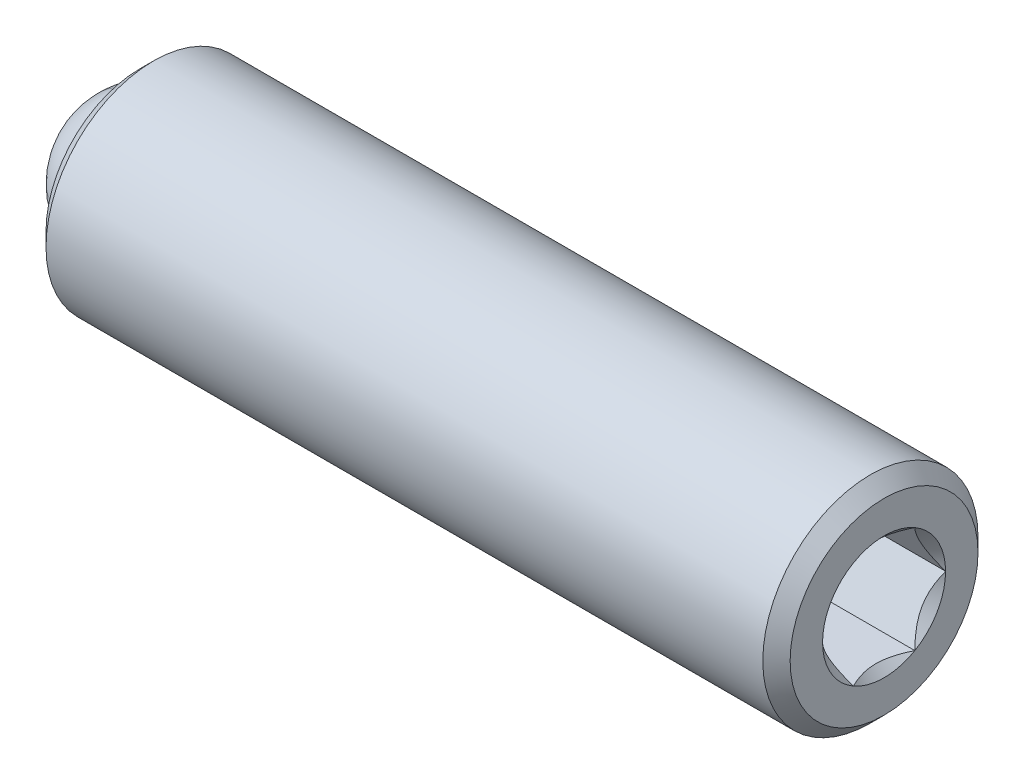
ISO-10303-21;
HEADER;
FILE_DESCRIPTION(('STEP AP214'),'2;1');
FILE_NAME('part.step','',(''),(''),'','','');
FILE_SCHEMA(('AUTOMOTIVE_DESIGN { 1 0 10303 214 1 1 1 1 }'));
ENDSEC;
DATA;
#1=APPLICATION_CONTEXT('core data for automotive mechanical design processes');
#2=APPLICATION_PROTOCOL_DEFINITION('international standard','automotive_design',2000,#1);
#3=PRODUCT_CONTEXT('',#1,'mechanical');
#4=PRODUCT('Part','Part','',(#3));
#5=PRODUCT_RELATED_PRODUCT_CATEGORY('part','',(#4));
#6=PRODUCT_DEFINITION_FORMATION('','',#4);
#7=PRODUCT_DEFINITION_CONTEXT('part definition',#1,'design');
#8=PRODUCT_DEFINITION('design','',#6,#7);
#9=PRODUCT_DEFINITION_SHAPE('','',#8);
#10=(LENGTH_UNIT() NAMED_UNIT(*) SI_UNIT(.MILLI.,.METRE.));
#11=(NAMED_UNIT(*) PLANE_ANGLE_UNIT() SI_UNIT($,.RADIAN.));
#12=(NAMED_UNIT(*) SI_UNIT($,.STERADIAN.) SOLID_ANGLE_UNIT());
#13=UNCERTAINTY_MEASURE_WITH_UNIT(LENGTH_MEASURE(1.E-05),#10,'distance_accuracy_value','');
#14=(GEOMETRIC_REPRESENTATION_CONTEXT(3) GLOBAL_UNCERTAINTY_ASSIGNED_CONTEXT((#13)) GLOBAL_UNIT_ASSIGNED_CONTEXT((#10,
#11,#12)) REPRESENTATION_CONTEXT('',''));
#15=CARTESIAN_POINT('',(0.,0.,0.));
#16=DIRECTION('',(0.,0.,1.));
#17=DIRECTION('',(1.,0.,0.));
#18=AXIS2_PLACEMENT_3D('',#15,#16,#17);
#19=CARTESIAN_POINT('',(-10.7420873794955,5.51648384237069,3.93165241246152));
#20=DIRECTION('',(1.,0.,0.));
#21=DIRECTION('',(0.,0.,-1.));
#22=AXIS2_PLACEMENT_3D('',#19,#20,#21);
#23=PLANE('',#22);
#24=CARTESIAN_POINT('',(-10.7420873794955,5.51648384237069,3.93165241246152));
#25=DIRECTION('',(1.,0.,0.));
#26=DIRECTION('',(0.,0.,-1.));
#27=AXIS2_PLACEMENT_3D('',#24,#25,#26);
#28=CIRCLE('',#27,0.99694999999999);
#29=CARTESIAN_POINT('',(-10.7420873794955,6.10907570675299,3.12993913156373));
#30=VERTEX_POINT('',#29);
#31=CARTESIAN_POINT('',(-10.7420873794955,6.50708384237069,3.81930944427936));
#32=VERTEX_POINT('',#31);
#33=EDGE_CURVE('P0_E11',#30,#32,#28,.T.);
#34=ORIENTED_EDGE('',*,*,#33,.F.);
#35=DIRECTION('',(0.,0.866025403784439,0.5));
#36=VECTOR('',#35,1.);
#37=CARTESIAN_POINT('',(-10.7420873794955,5.51648384237069,2.78780605914303));
#38=LINE('',#37,#36);
#39=CARTESIAN_POINT('',(-10.7420873794955,6.50708384237069,3.35972923580227));
#40=VERTEX_POINT('',#39);
#41=EDGE_CURVE('P0_E247',#30,#40,#38,.T.);
#42=ORIENTED_EDGE('',*,*,#41,.T.);
#43=DIRECTION('',(0.,0.,1.));
#44=VECTOR('',#43,1.);
#45=CARTESIAN_POINT('',(-10.7420873794955,6.50708384237069,3.35972923580227));
#46=LINE('',#45,#44);
#47=EDGE_CURVE('P0_E254',#40,#32,#46,.T.);
#48=ORIENTED_EDGE('',*,*,#47,.T.);
#49=EDGE_LOOP('',(#34,#42,#48));
#50=FACE_BOUND('',#49,.T.);
#51=ADVANCED_FACE('P0_F17',(#50),#23,.T.);
#52=CARTESIAN_POINT('',(-10.7420873794955,6.50708384237069,4.04399538064368));
#53=VERTEX_POINT('',#52);
#54=CARTESIAN_POINT('',(-10.7420873794955,6.10907570675299,4.7333656933593));
#55=VERTEX_POINT('',#54);
#56=EDGE_CURVE('P0_E32',#53,#55,#28,.T.);
#57=ORIENTED_EDGE('',*,*,#56,.F.);
#58=CARTESIAN_POINT('',(-10.7420873794955,6.50708384237069,4.50357558912076));
#59=VERTEX_POINT('',#58);
#60=EDGE_CURVE('P0_E252',#53,#59,#46,.T.);
#61=ORIENTED_EDGE('',*,*,#60,.T.);
#62=DIRECTION('',(0.,-0.866025403784439,0.5));
#63=VECTOR('',#62,1.);
#64=CARTESIAN_POINT('',(-10.7420873794955,6.50708384237069,4.50357558912076));
#65=LINE('',#64,#63);
#66=EDGE_CURVE('P0_E228',#59,#55,#65,.T.);
#67=ORIENTED_EDGE('',*,*,#66,.T.);
#68=EDGE_LOOP('',(#57,#61,#67));
#69=FACE_BOUND('',#68,.T.);
#70=ADVANCED_FACE('P0_F346',(#69),#23,.T.);
#71=CARTESIAN_POINT('',(-10.7420873794955,5.91449197798839,4.84570866154146));
#72=VERTEX_POINT('',#71);
#73=CARTESIAN_POINT('',(-10.7420873794955,5.11847570675299,4.84570866154147));
#74=VERTEX_POINT('',#73);
#75=EDGE_CURVE('P0_E327',#72,#74,#28,.T.);
#76=ORIENTED_EDGE('',*,*,#75,.F.);
#77=CARTESIAN_POINT('',(-10.7420873794955,5.51648384237069,5.07549876578));
#78=VERTEX_POINT('',#77);
#79=EDGE_CURVE('P0_E233',#72,#78,#65,.T.);
#80=ORIENTED_EDGE('',*,*,#79,.T.);
#81=DIRECTION('',(0.,-0.866025403784439,-0.5));
#82=VECTOR('',#81,1.);
#83=CARTESIAN_POINT('',(-10.7420873794955,5.51648384237069,5.07549876578));
#84=LINE('',#83,#82);
#85=EDGE_CURVE('P0_E234',#78,#74,#84,.T.);
#86=ORIENTED_EDGE('',*,*,#85,.T.);
#87=EDGE_LOOP('',(#76,#80,#86));
#88=FACE_BOUND('',#87,.T.);
#89=ADVANCED_FACE('P0_F393',(#88),#23,.T.);
#90=CARTESIAN_POINT('',(-10.7420873794955,4.92389197798839,4.7333656933593));
#91=VERTEX_POINT('',#90);
#92=CARTESIAN_POINT('',(-10.7420873794955,4.52588384237069,4.04399538064369));
#93=VERTEX_POINT('',#92);
#94=EDGE_CURVE('P0_E322',#91,#93,#28,.T.);
#95=ORIENTED_EDGE('',*,*,#94,.F.);
#96=CARTESIAN_POINT('',(-10.7420873794955,4.52588384237069,4.50357558912076));
#97=VERTEX_POINT('',#96);
#98=EDGE_CURVE('P0_E231',#91,#97,#84,.T.);
#99=ORIENTED_EDGE('',*,*,#98,.T.);
#100=DIRECTION('',(0.,0.,-1.));
#101=VECTOR('',#100,1.);
#102=CARTESIAN_POINT('',(-10.7420873794955,4.52588384237069,4.50357558912076));
#103=LINE('',#102,#101);
#104=EDGE_CURVE('P0_E239',#97,#93,#103,.T.);
#105=ORIENTED_EDGE('',*,*,#104,.T.);
#106=EDGE_LOOP('',(#95,#99,#105));
#107=FACE_BOUND('',#106,.T.);
#108=ADVANCED_FACE('P0_F404',(#107),#23,.T.);
#109=CARTESIAN_POINT('',(-10.7420873794955,4.52588384237069,3.81930944427935));
#110=VERTEX_POINT('',#109);
#111=CARTESIAN_POINT('',(-10.7420873794955,4.92389197798838,3.12993913156374));
#112=VERTEX_POINT('',#111);
#113=EDGE_CURVE('P0_E319',#110,#112,#28,.T.);
#114=ORIENTED_EDGE('',*,*,#113,.F.);
#115=CARTESIAN_POINT('',(-10.7420873794955,4.52588384237069,3.35972923580227));
#116=VERTEX_POINT('',#115);
#117=EDGE_CURVE('P0_E237',#110,#116,#103,.T.);
#118=ORIENTED_EDGE('',*,*,#117,.T.);
#119=DIRECTION('',(0.,0.866025403784439,-0.5));
#120=VECTOR('',#119,1.);
#121=CARTESIAN_POINT('',(-10.7420873794955,4.52588384237069,3.35972923580227));
#122=LINE('',#121,#120);
#123=EDGE_CURVE('P0_E244',#116,#112,#122,.T.);
#124=ORIENTED_EDGE('',*,*,#123,.T.);
#125=EDGE_LOOP('',(#114,#118,#124));
#126=FACE_BOUND('',#125,.T.);
#127=ADVANCED_FACE('P0_F397',(#126),#23,.T.);
#128=CARTESIAN_POINT('',(-21.5256873794955,6.91348384237069,3.93165241246152));
#129=DIRECTION('',(1.,0.,0.));
#130=DIRECTION('',(0.,1.,0.));
#131=AXIS2_PLACEMENT_3D('',#128,#129,#130);
#132=PLANE('',#131);
#133=CARTESIAN_POINT('',(-21.5256873794955,5.51648384237069,3.93165241246152));
#134=DIRECTION('',(1.,0.,0.));
#135=DIRECTION('',(0.,1.,0.));
#136=AXIS2_PLACEMENT_3D('',#133,#134,#135);
#137=CIRCLE('',#136,1.746);
#138=CARTESIAN_POINT('',(-21.5256873794955,7.26248384237069,3.93165241246152));
#139=VERTEX_POINT('',#138);
#140=EDGE_CURVE('P0_E313',#139,#139,#137,.F.);
#141=ORIENTED_EDGE('',*,*,#140,.T.);
#142=EDGE_LOOP('',(#141));
#143=FACE_BOUND('',#142,.T.);
#144=CARTESIAN_POINT('',(-21.5256873794955,5.51648384237069,3.93165241246152));
#145=DIRECTION('',(-1.,0.,0.));
#146=DIRECTION('',(0.,-1.,0.));
#147=AXIS2_PLACEMENT_3D('',#144,#145,#146);
#148=CIRCLE('',#147,1.397);
#149=CARTESIAN_POINT('',(-21.5256873794955,4.11948384237069,3.93165241246152));
#150=VERTEX_POINT('',#149);
#151=EDGE_CURVE('P0_E302',#150,#150,#148,.T.);
#152=ORIENTED_EDGE('',*,*,#151,.F.);
#153=EDGE_LOOP('',(#152));
#154=FACE_BOUND('',#153,.T.);
#155=ADVANCED_FACE('P0_F403',(#143,#154),#132,.F.);
#156=CARTESIAN_POINT('',(-19.3405938530116,5.51648384237069,3.93165241246152));
#157=DIRECTION('',(-1.,0.,0.));
#158=DIRECTION('',(0.,-1.,0.));
#159=AXIS2_PLACEMENT_3D('',#156,#157,#158);
#160=CYLINDRICAL_SURFACE('',#159,1.397);
#161=CARTESIAN_POINT('',(-20.7375938530116,5.51648384237069,3.93165241246152));
#162=DIRECTION('',(-1.,0.,0.));
#163=DIRECTION('',(0.,-1.,0.));
#164=AXIS2_PLACEMENT_3D('',#161,#162,#163);
#165=CIRCLE('',#164,1.397);
#166=CARTESIAN_POINT('',(-20.7375938530116,4.11948384237069,3.93165241246152));
#167=VERTEX_POINT('',#166);
#168=EDGE_CURVE('P0_E285',#167,#167,#165,.T.);
#169=ORIENTED_EDGE('',*,*,#168,.F.);
#170=EDGE_LOOP('',(#169));
#171=FACE_BOUND('',#170,.T.);
#172=ORIENTED_EDGE('',*,*,#151,.T.);
#173=EDGE_LOOP('',(#172));
#174=FACE_BOUND('',#173,.T.);
#175=ADVANCED_FACE('P0_F410',(#171,#174),#160,.F.);
#176=CARTESIAN_POINT('',(-20.7375938530116,5.51648384237069,3.93165241246152));
#177=DIRECTION('',(-1.,0.,0.));
#178=DIRECTION('',(0.,-1.,0.));
#179=AXIS2_PLACEMENT_3D('',#176,#177,#178);
#180=CONICAL_SURFACE('',#179,1.397,0.78539816339745);
#181=CARTESIAN_POINT('',(-19.3405938530116,5.51648384237069,3.93165241246152));
#182=VERTEX_POINT('',#181);
#183=VERTEX_LOOP('',#182);
#184=FACE_BOUND('',#183,.T.);
#185=ORIENTED_EDGE('',*,*,#168,.T.);
#186=EDGE_LOOP('',(#185));
#187=FACE_BOUND('',#186,.T.);
#188=ADVANCED_FACE('P0_F601',(#184,#187),#180,.F.);
#189=CARTESIAN_POINT('',(-7.69408737949552,5.51648384237069,3.93165241246152));
#190=DIRECTION('',(-1.,0.,0.));
#191=DIRECTION('',(0.,-1.,0.));
#192=AXIS2_PLACEMENT_3D('',#189,#190,#191);
#193=PLANE('',#192);
#194=DIRECTION('',(0.,-0.866025403784439,-0.5));
#195=VECTOR('',#194,1.);
#196=CARTESIAN_POINT('',(-7.69408737949552,5.51648384237069,5.07549876578));
#197=LINE('',#196,#195);
#198=CARTESIAN_POINT('',(-7.69408737949552,4.52735140115201,4.50442288457821));
#199=VERTEX_POINT('',#198);
#200=CARTESIAN_POINT('',(-7.69408737949552,4.52588384237069,4.50357558912076));
#201=VERTEX_POINT('',#200);
#202=EDGE_CURVE('P0_E262',#199,#201,#197,.T.);
#203=ORIENTED_EDGE('',*,*,#202,.F.);
#204=CARTESIAN_POINT('',(-7.69408737949552,5.51648384237069,3.93165241246152));
#205=DIRECTION('',(1.,0.,0.));
#206=DIRECTION('',(0.,1.,0.));
#207=AXIS2_PLACEMENT_3D('',#204,#205,#206);
#208=CIRCLE('',#207,1.143);
#209=CARTESIAN_POINT('',(-7.69408737949552,5.51501628358937,5.07465147032256));
#210=VERTEX_POINT('',#209);
#211=EDGE_CURVE('P0_E359',#210,#199,#208,.T.);
#212=ORIENTED_EDGE('',*,*,#211,.F.);
#213=CARTESIAN_POINT('',(-7.69408737949552,5.51648384237069,5.07549876578));
#214=VERTEX_POINT('',#213);
#215=EDGE_CURVE('P0_E263',#214,#210,#197,.T.);
#216=ORIENTED_EDGE('',*,*,#215,.F.);
#217=DIRECTION('',(0.,-0.866025403784439,0.5));
#218=VECTOR('',#217,1.);
#219=CARTESIAN_POINT('',(-7.69408737949552,6.50708384237069,4.50357558912076));
#220=LINE('',#219,#218);
#221=CARTESIAN_POINT('',(-7.69408737949552,5.51794976931946,5.07465241246152));
#222=VERTEX_POINT('',#221);
#223=EDGE_CURVE('P0_E221',#222,#214,#220,.T.);
#224=ORIENTED_EDGE('',*,*,#223,.F.);
#225=CARTESIAN_POINT('',(-7.69408737949552,6.50561628358937,4.50442288457821));
#226=VERTEX_POINT('',#225);
#227=EDGE_CURVE('P0_E48',#226,#222,#208,.T.);
#228=ORIENTED_EDGE('',*,*,#227,.F.);
#229=CARTESIAN_POINT('',(-7.69408737949552,6.50708384237069,4.50357558912076));
#230=VERTEX_POINT('',#229);
#231=EDGE_CURVE('P0_E259',#230,#226,#220,.T.);
#232=ORIENTED_EDGE('',*,*,#231,.F.);
#233=DIRECTION('',(0.,0.,1.));
#234=VECTOR('',#233,1.);
#235=CARTESIAN_POINT('',(-7.69408737949552,6.50708384237069,3.35972923580227));
#236=LINE('',#235,#234);
#237=CARTESIAN_POINT('',(-7.69408737949552,6.50708384237069,4.50188099820586));
#238=VERTEX_POINT('',#237);
#239=EDGE_CURVE('P0_E278',#238,#230,#236,.T.);
#240=ORIENTED_EDGE('',*,*,#239,.F.);
#241=CARTESIAN_POINT('',(-7.69408737949552,6.50708384237069,3.36142382671717));
#242=VERTEX_POINT('',#241);
#243=EDGE_CURVE('P0_E165',#242,#238,#208,.T.);
#244=ORIENTED_EDGE('',*,*,#243,.F.);
#245=CARTESIAN_POINT('',(-7.69408737949552,6.50708384237069,3.35972923580227));
#246=VERTEX_POINT('',#245);
#247=EDGE_CURVE('P0_E279',#246,#242,#236,.T.);
#248=ORIENTED_EDGE('',*,*,#247,.F.);
#249=DIRECTION('',(0.,0.866025403784439,0.5));
#250=VECTOR('',#249,1.);
#251=CARTESIAN_POINT('',(-7.69408737949552,5.51648384237069,2.78780605914303));
#252=LINE('',#251,#250);
#253=CARTESIAN_POINT('',(-7.69408737949552,6.50561628358937,3.35888194034483));
#254=VERTEX_POINT('',#253);
#255=EDGE_CURVE('P0_E274',#254,#246,#252,.T.);
#256=ORIENTED_EDGE('',*,*,#255,.F.);
#257=CARTESIAN_POINT('',(-7.69408737949552,5.51795140115201,2.78865335460048));
#258=VERTEX_POINT('',#257);
#259=EDGE_CURVE('P0_E168',#258,#254,#208,.T.);
#260=ORIENTED_EDGE('',*,*,#259,.F.);
#261=CARTESIAN_POINT('',(-7.69408737949552,5.51648384237069,2.78780605914303));
#262=VERTEX_POINT('',#261);
#263=EDGE_CURVE('P0_E275',#262,#258,#252,.T.);
#264=ORIENTED_EDGE('',*,*,#263,.F.);
#265=DIRECTION('',(0.,0.866025403784439,-0.5));
#266=VECTOR('',#265,1.);
#267=CARTESIAN_POINT('',(-7.69408737949552,4.52588384237069,3.35972923580227));
#268=LINE('',#267,#266);
#269=CARTESIAN_POINT('',(-7.69408737949552,5.51501791542192,2.78865241246152));
#270=VERTEX_POINT('',#269);
#271=EDGE_CURVE('P0_E270',#270,#262,#268,.T.);
#272=ORIENTED_EDGE('',*,*,#271,.F.);
#273=CARTESIAN_POINT('',(-7.69408737949552,4.52735140115201,3.35888194034483));
#274=VERTEX_POINT('',#273);
#275=EDGE_CURVE('P0_E363',#274,#270,#208,.T.);
#276=ORIENTED_EDGE('',*,*,#275,.F.);
#277=CARTESIAN_POINT('',(-7.69408737949552,4.52588384237069,3.35972923580227));
#278=VERTEX_POINT('',#277);
#279=EDGE_CURVE('P0_E271',#278,#274,#268,.T.);
#280=ORIENTED_EDGE('',*,*,#279,.F.);
#281=DIRECTION('',(0.,0.,-1.));
#282=VECTOR('',#281,1.);
#283=CARTESIAN_POINT('',(-7.69408737949552,4.52588384237069,4.50357558912076));
#284=LINE('',#283,#282);
#285=CARTESIAN_POINT('',(-7.69408737949552,4.52588384237069,3.36142382671717));
#286=VERTEX_POINT('',#285);
#287=EDGE_CURVE('P0_E266',#286,#278,#284,.T.);
#288=ORIENTED_EDGE('',*,*,#287,.F.);
#289=CARTESIAN_POINT('',(-7.69408737949552,4.52588384237069,4.50188099820587));
#290=VERTEX_POINT('',#289);
#291=EDGE_CURVE('P0_E360',#290,#286,#208,.T.);
#292=ORIENTED_EDGE('',*,*,#291,.F.);
#293=EDGE_CURVE('P0_E267',#201,#290,#284,.T.);
#294=ORIENTED_EDGE('',*,*,#293,.F.);
#295=EDGE_LOOP('',(#203,#212,#216,#224,#228,#232,#240,#244,#248,#256,#260,#264,#272,#276,#280,
#288,#292,#294));
#296=FACE_BOUND('',#295,.T.);
#297=CARTESIAN_POINT('',(-7.69408737949552,5.51648384237069,3.93165241246152));
#298=DIRECTION('',(-1.,0.,0.));
#299=DIRECTION('',(0.,-1.,0.));
#300=AXIS2_PLACEMENT_3D('',#297,#298,#299);
#301=CIRCLE('',#300,1.746);
#302=CARTESIAN_POINT('',(-7.69408737949552,3.77048384237069,3.93165241246152));
#303=VERTEX_POINT('',#302);
#304=EDGE_CURVE('P0_E311',#303,#303,#301,.F.);
#305=ORIENTED_EDGE('',*,*,#304,.T.);
#306=EDGE_LOOP('',(#305));
#307=FACE_BOUND('',#306,.T.);
#308=ADVANCED_FACE('P0_F354',(#296,#307),#193,.F.);
#309=CARTESIAN_POINT('',(-19.3405938530116,5.51648384237069,3.93165241246152));
#310=DIRECTION('',(-1.,0.,0.));
#311=DIRECTION('',(0.,-1.,0.));
#312=AXIS2_PLACEMENT_3D('',#309,#310,#311);
#313=CYLINDRICAL_SURFACE('',#312,2.);
#314=CARTESIAN_POINT('',(-7.94808737949551,5.51648384237069,3.93165241246152));
#315=DIRECTION('',(-1.,0.,0.));
#316=DIRECTION('',(0.,-1.,0.));
#317=AXIS2_PLACEMENT_3D('',#314,#315,#316);
#318=CIRCLE('',#317,2.);
#319=CARTESIAN_POINT('',(-7.94808737949551,3.51648384237069,3.93165241246152));
#320=VERTEX_POINT('',#319);
#321=EDGE_CURVE('P0_E308',#320,#320,#318,.T.);
#322=ORIENTED_EDGE('',*,*,#321,.T.);
#323=EDGE_LOOP('',(#322));
#324=FACE_BOUND('',#323,.T.);
#325=CARTESIAN_POINT('',(-21.2716873794955,5.51648384237069,3.93165241246152));
#326=DIRECTION('',(1.,0.,0.));
#327=DIRECTION('',(0.,1.,0.));
#328=AXIS2_PLACEMENT_3D('',#325,#326,#327);
#329=CIRCLE('',#328,2.);
#330=CARTESIAN_POINT('',(-21.2716873794955,7.51648384237069,3.93165241246152));
#331=VERTEX_POINT('',#330);
#332=EDGE_CURVE('P0_E305',#331,#331,#329,.T.);
#333=ORIENTED_EDGE('',*,*,#332,.T.);
#334=EDGE_LOOP('',(#333));
#335=FACE_BOUND('',#334,.T.);
#336=ADVANCED_FACE('P0_F211',(#324,#335),#313,.T.);
#337=CARTESIAN_POINT('',(-7.94808737949551,5.51648384237069,3.93165241246152));
#338=DIRECTION('',(-1.,0.,0.));
#339=DIRECTION('',(0.,-1.,0.));
#340=AXIS2_PLACEMENT_3D('',#337,#338,#339);
#341=CONICAL_SURFACE('',#340,2.,0.785398163397453);
#342=ORIENTED_EDGE('',*,*,#304,.F.);
#343=EDGE_LOOP('',(#342));
#344=FACE_BOUND('',#343,.T.);
#345=ORIENTED_EDGE('',*,*,#321,.F.);
#346=EDGE_LOOP('',(#345));
#347=FACE_BOUND('',#346,.T.);
#348=ADVANCED_FACE('P0_F574',(#344,#347),#341,.T.);
#349=CARTESIAN_POINT('',(-21.5256873794955,5.51648384237069,3.93165241246152));
#350=DIRECTION('',(1.,0.,0.));
#351=DIRECTION('',(0.,1.,0.));
#352=AXIS2_PLACEMENT_3D('',#349,#350,#351);
#353=CONICAL_SURFACE('',#352,1.746,0.785398163397449);
#354=ORIENTED_EDGE('',*,*,#332,.F.);
#355=EDGE_LOOP('',(#354));
#356=FACE_BOUND('',#355,.T.);
#357=ORIENTED_EDGE('',*,*,#140,.F.);
#358=EDGE_LOOP('',(#357));
#359=FACE_BOUND('',#358,.T.);
#360=ADVANCED_FACE('P0_F19',(#356,#359),#353,.T.);
#361=CARTESIAN_POINT('',(-10.7420873794955,6.50708384237069,4.50357558912076));
#362=DIRECTION('',(0.,0.5,0.866025403784439));
#363=DIRECTION('',(0.,-0.866025403784439,0.5));
#364=AXIS2_PLACEMENT_3D('',#361,#362,#363);
#365=PLANE('',#364);
#366=ORIENTED_EDGE('',*,*,#231,.T.);
#367=CARTESIAN_POINT('',(-7.6938873794953,6.50596337452511,4.50422249153302));
#368=CARTESIAN_POINT('',(-7.713453838116,6.471983322323,4.52384088381899));
#369=CARTESIAN_POINT('',(-7.73186799338871,6.43743587594858,4.54378686128308));
#370=CARTESIAN_POINT('',(-7.76557809857301,6.36699403376715,4.58445647782873));
#371=CARTESIAN_POINT('',(-7.78085539179168,6.33109300156892,4.60518394843257));
#372=CARTESIAN_POINT('',(-7.80702223300025,6.2587009267263,4.64697953233015));
#373=CARTESIAN_POINT('',(-7.81797726310524,6.22222815514235,4.66803709682224));
#374=CARTESIAN_POINT('',(-7.83485334005861,6.14848373537454,4.71061345742642));
#375=CARTESIAN_POINT('',(-7.84078690231258,6.11121431212345,4.73213096897298));
#376=CARTESIAN_POINT('',(-7.84614076805165,6.04691960471684,4.76925153560165));
#377=CARTESIAN_POINT('',(-7.84692818819318,6.01997693222904,4.78480689481517));
#378=CARTESIAN_POINT('',(-7.84557478248429,5.96614441254597,4.81588711454535));
#379=CARTESIAN_POINT('',(-7.84343330522417,5.93925457843453,4.83141196750805));
#380=CARTESIAN_POINT('',(-7.83275737126075,5.85897041588197,4.87776405036943));
#381=CARTESIAN_POINT('',(-7.8199702582222,5.80597636268158,4.90836018125013));
#382=CARTESIAN_POINT('',(-7.78920908680458,5.71322726676513,4.96190889674459));
#383=CARTESIAN_POINT('',(-7.77288514718562,5.67302646649351,4.98511883960304));
#384=CARTESIAN_POINT('',(-7.73613189032961,5.59419073523987,5.03063467026409));
#385=CARTESIAN_POINT('',(-7.71571597269682,5.55555117555161,5.05294323045148));
#386=CARTESIAN_POINT('',(-7.69388737949552,5.51760431021663,5.07485186336753));
#387=B_SPLINE_CURVE_WITH_KNOTS('',3,(#367,#368,#369,#370,#371,#372,#373,#374,#375,#376,#377,
#378,#379,#380,#381,#382,#383,#384,#385,#386),.UNSPECIFIED.,.F.,.F.,(4,2,2,2,2,2,2,2,2,4),(0.,
0.131625127619601,0.264011770716204,0.394307736662358,0.524277991049733,0.617504646941288,
0.71075204054236,0.897297861024574,1.04472299547961,1.19167303462289),.UNSPECIFIED.);
#388=EDGE_CURVE('P0_E214',#226,#222,#387,.T.);
#389=ORIENTED_EDGE('',*,*,#388,.T.);
#390=ORIENTED_EDGE('',*,*,#223,.T.);
#391=DIRECTION('',(1.,0.,0.));
#392=VECTOR('',#391,1.);
#393=CARTESIAN_POINT('',(-10.7420873794955,5.51648384237069,5.07549876578));
#394=LINE('',#393,#392);
#395=EDGE_CURVE('P0_E257',#78,#214,#394,.T.);
#396=ORIENTED_EDGE('',*,*,#395,.F.);
#397=ORIENTED_EDGE('',*,*,#79,.F.);
#398=EDGE_CURVE('P0_E232',#55,#72,#65,.T.);
#399=ORIENTED_EDGE('',*,*,#398,.F.);
#400=ORIENTED_EDGE('',*,*,#66,.F.);
#401=DIRECTION('',(1.,0.,0.));
#402=VECTOR('',#401,1.);
#403=CARTESIAN_POINT('',(-10.7420873794955,6.50708384237069,4.50357558912076));
#404=LINE('',#403,#402);
#405=EDGE_CURVE('P0_E282',#59,#230,#404,.T.);
#406=ORIENTED_EDGE('',*,*,#405,.T.);
#407=EDGE_LOOP('',(#366,#389,#390,#396,#397,#399,#400,#406));
#408=FACE_BOUND('',#407,.T.);
#409=ADVANCED_FACE('P0_F205',(#408),#365,.F.);
#410=CARTESIAN_POINT('',(-10.7420873794955,6.50708384237069,3.35972923580227));
#411=DIRECTION('',(0.,1.,0.));
#412=DIRECTION('',(0.,0.,1.));
#413=AXIS2_PLACEMENT_3D('',#410,#411,#412);
#414=PLANE('',#413);
#415=ORIENTED_EDGE('',*,*,#247,.T.);
#416=CARTESIAN_POINT('',(-7.32677716271978,6.50708384237069,2.79158724287814));
#417=CARTESIAN_POINT('',(-7.34773062178313,6.50708384237069,2.81934972954323));
#418=CARTESIAN_POINT('',(-7.36847845868332,6.50708384237069,2.84726697138107));
#419=CARTESIAN_POINT('',(-7.40947796841487,6.50708384237069,2.9034737272973));
#420=CARTESIAN_POINT('',(-7.42972951619549,6.50708384237069,2.9317633324959));
#421=CARTESIAN_POINT('',(-7.48990131914477,6.50708384237069,3.01769902881535));
#422=CARTESIAN_POINT('',(-7.52891600448646,6.50708384237069,3.07598988844291));
#423=CARTESIAN_POINT('',(-7.60550115343196,6.50708384237069,3.1982197910528));
#424=CARTESIAN_POINT('',(-7.64286247623841,6.50708384237069,3.26229138308053));
#425=CARTESIAN_POINT('',(-7.7112005733348,6.50708384237069,3.39363406286549));
#426=CARTESIAN_POINT('',(-7.74219887018847,6.50708384237069,3.46089338506918));
#427=CARTESIAN_POINT('',(-7.7801222365842,6.50708384237069,3.56185581070988));
#428=CARTESIAN_POINT('',(-7.79100748989082,6.50708384237069,3.59406539169312));
#429=CARTESIAN_POINT('',(-7.81019203037297,6.50708384237069,3.65926164578233));
#430=CARTESIAN_POINT('',(-7.81849113923572,6.50708384237069,3.69224837230333));
#431=CARTESIAN_POINT('',(-7.83193318559999,6.50708384237069,3.75824562294744));
#432=CARTESIAN_POINT('',(-7.83713061923513,6.50708384237069,3.79124487185808));
#433=CARTESIAN_POINT('',(-7.8442712565911,6.50708384237069,3.85760640650123));
#434=CARTESIAN_POINT('',(-7.84621396267566,6.50708384237069,3.89096874696442));
#435=CARTESIAN_POINT('',(-7.84669796202281,6.50708384237069,3.95651194297424));
#436=CARTESIAN_POINT('',(-7.84535956916216,6.50708384237069,3.98869195142282));
#437=CARTESIAN_POINT('',(-7.83962144921793,6.50708384237069,4.052765329349));
#438=CARTESIAN_POINT('',(-7.83522242556394,6.50708384237069,4.08465876298482));
#439=CARTESIAN_POINT('',(-7.82352850125357,6.50708384237069,4.14848403423969));
#440=CARTESIAN_POINT('',(-7.81618388418638,6.50708384237069,4.18040662425168));
#441=CARTESIAN_POINT('',(-7.79898898316744,6.50708384237069,4.24355437910285));
#442=CARTESIAN_POINT('',(-7.78913890959597,6.50708384237069,4.27477960225976));
#443=CARTESIAN_POINT('',(-7.7544138834323,6.50708384237069,4.37311544076267));
#444=CARTESIAN_POINT('',(-7.7255830497671,6.50708384237069,4.43882572098251));
#445=CARTESIAN_POINT('',(-7.66148197120503,6.50708384237069,4.5671591162398));
#446=CARTESIAN_POINT('',(-7.62618858606116,6.50708384237069,4.62977007596242));
#447=CARTESIAN_POINT('',(-7.55337605358868,6.50708384237069,4.74942824320657));
#448=CARTESIAN_POINT('',(-7.51605469712101,6.50708384237069,4.80659731535348));
#449=CARTESIAN_POINT('',(-7.45836009340079,6.50708384237069,4.8908244507382));
#450=CARTESIAN_POINT('',(-7.43892519787927,6.50708384237069,4.91853663392902));
#451=CARTESIAN_POINT('',(-7.39954148527137,6.50708384237069,4.97358234043768));
#452=CARTESIAN_POINT('',(-7.37959281017387,6.50708384237069,5.00091596523051));
#453=CARTESIAN_POINT('',(-7.35943110653965,6.50708384237069,5.02809196893776));
#454=B_SPLINE_CURVE_WITH_KNOTS('',3,(#416,#417,#418,#419,#420,#421,#422,#423,#424,#425,#426,
#427,#428,#429,#430,#431,#432,#433,#434,#435,#436,#437,#438,#439,#440,#441,#442,#443,#444,#445,
#446,#447,#448,#449,#450,#451,#452,#453),.UNSPECIFIED.,.F.,.F.,(4,2,2,2,2,2,2,2,2,2,2,2,2,2,2,2,
2,2,4),(0.,0.104344019556666,0.208714065995309,0.41904723860194,0.641371595426509,
0.862931089855695,0.964842435960926,1.06676080722523,1.16683130424735,1.26691710029625,
1.36338812254199,1.45983698002154,1.55798726512869,1.65612931138883,1.87076833826788,
2.08619150382141,2.29090841446406,2.39244822901591,2.49396027677513),.UNSPECIFIED.);
#455=EDGE_CURVE('P0_E222',#242,#238,#454,.T.);
#456=ORIENTED_EDGE('',*,*,#455,.T.);
#457=ORIENTED_EDGE('',*,*,#239,.T.);
#458=ORIENTED_EDGE('',*,*,#405,.F.);
#459=ORIENTED_EDGE('',*,*,#60,.F.);
#460=EDGE_CURVE('P0_E258',#32,#53,#46,.T.);
#461=ORIENTED_EDGE('',*,*,#460,.F.);
#462=ORIENTED_EDGE('',*,*,#47,.F.);
#463=DIRECTION('',(1.,0.,0.));
#464=VECTOR('',#463,1.);
#465=CARTESIAN_POINT('',(-10.7420873794955,6.50708384237069,3.35972923580227));
#466=LINE('',#465,#464);
#467=EDGE_CURVE('P0_E286',#40,#246,#466,.T.);
#468=ORIENTED_EDGE('',*,*,#467,.T.);
#469=EDGE_LOOP('',(#415,#456,#457,#458,#459,#461,#462,#468));
#470=FACE_BOUND('',#469,.T.);
#471=ADVANCED_FACE('P0_F209',(#470),#414,.F.);
#472=CARTESIAN_POINT('',(-10.7420873794955,5.51648384237069,2.78780605914303));
#473=DIRECTION('',(0.,0.5,-0.866025403784439));
#474=DIRECTION('',(0.,0.866025403784439,0.5));
#475=AXIS2_PLACEMENT_3D('',#472,#473,#474);
#476=PLANE('',#475);
#477=ORIENTED_EDGE('',*,*,#263,.T.);
#478=CARTESIAN_POINT('',(-7.69388737949552,5.51760431021663,2.7884529615555));
#479=CARTESIAN_POINT('',(-7.71345383811619,5.55158436241873,2.80807135384146));
#480=CARTESIAN_POINT('',(-7.73186799338888,5.58613180879313,2.82801733130553));
#481=CARTESIAN_POINT('',(-7.76557809857313,5.6565736509745,2.86868694785116));
#482=CARTESIAN_POINT('',(-7.78085539179178,5.69247468317271,2.88941441845499));
#483=CARTESIAN_POINT('',(-7.80702223300031,5.76486675801528,2.93121000235254));
#484=CARTESIAN_POINT('',(-7.81797726310529,5.8013395295992,2.95226756684461));
#485=CARTESIAN_POINT('',(-7.83485334005864,5.87508394936696,2.99484392744876));
#486=CARTESIAN_POINT('',(-7.84078690231259,5.91235337261803,3.0163614389953));
#487=CARTESIAN_POINT('',(-7.84614076805165,5.97664808002461,3.05348200562396));
#488=CARTESIAN_POINT('',(-7.84692818819318,6.00359075251241,3.06903736483748));
#489=CARTESIAN_POINT('',(-7.84557478248428,6.05742327219547,3.10011758456765));
#490=CARTESIAN_POINT('',(-7.84343330522416,6.08431310630691,3.11564243753035));
#491=CARTESIAN_POINT('',(-7.83275737126074,6.16459726885946,3.16199452039173));
#492=CARTESIAN_POINT('',(-7.81997025822219,6.21759132205986,3.19259065127243));
#493=CARTESIAN_POINT('',(-7.78920908680455,6.31034041797636,3.24613936676692));
#494=CARTESIAN_POINT('',(-7.77288514718555,6.35054121824803,3.26934930962541));
#495=CARTESIAN_POINT('',(-7.73613189032947,6.42937694950178,3.31486514028652));
#496=CARTESIAN_POINT('',(-7.71571597269665,6.46801650919009,3.33717370047393));
#497=CARTESIAN_POINT('',(-7.6938873794953,6.50596337452511,3.35908233339001));
#498=B_SPLINE_CURVE_WITH_KNOTS('',3,(#478,#479,#480,#481,#482,#483,#484,#485,#486,#487,#488,
#489,#490,#491,#492,#493,#494,#495,#496,#497),.UNSPECIFIED.,.F.,.F.,(4,2,2,2,2,2,2,2,2,4),(0.,
0.131625127619503,0.264011770716006,0.394307736662061,0.524277991049337,0.617504646940889,
0.710752040541955,0.897297861024162,1.04472299547941,1.19167303462289),.UNSPECIFIED.);
#499=EDGE_CURVE('P0_E373',#258,#254,#498,.T.);
#500=ORIENTED_EDGE('',*,*,#499,.T.);
#501=ORIENTED_EDGE('',*,*,#255,.T.);
#502=ORIENTED_EDGE('',*,*,#467,.F.);
#503=ORIENTED_EDGE('',*,*,#41,.F.);
#504=CARTESIAN_POINT('',(-10.7420873794955,5.91449197798839,3.01759616338157));
#505=VERTEX_POINT('',#504);
#506=EDGE_CURVE('P0_E253',#505,#30,#38,.T.);
#507=ORIENTED_EDGE('',*,*,#506,.F.);
#508=CARTESIAN_POINT('',(-10.7420873794955,5.51648384237069,2.78780605914303));
#509=VERTEX_POINT('',#508);
#510=EDGE_CURVE('P0_E249',#509,#505,#38,.T.);
#511=ORIENTED_EDGE('',*,*,#510,.F.);
#512=DIRECTION('',(1.,0.,0.));
#513=VECTOR('',#512,1.);
#514=CARTESIAN_POINT('',(-10.7420873794955,5.51648384237069,2.78780605914303));
#515=LINE('',#514,#513);
#516=EDGE_CURVE('P0_E289',#509,#262,#515,.T.);
#517=ORIENTED_EDGE('',*,*,#516,.T.);
#518=EDGE_LOOP('',(#477,#500,#501,#502,#503,#507,#511,#517));
#519=FACE_BOUND('',#518,.T.);
#520=ADVANCED_FACE('P0_F377',(#519),#476,.F.);
#521=CARTESIAN_POINT('',(-10.7420873794955,4.52588384237069,3.35972923580227));
#522=DIRECTION('',(0.,-0.5,-0.866025403784439));
#523=DIRECTION('',(0.,0.866025403784439,-0.5));
#524=AXIS2_PLACEMENT_3D('',#521,#522,#523);
#525=PLANE('',#524);
#526=ORIENTED_EDGE('',*,*,#279,.T.);
#527=CARTESIAN_POINT('',(-7.6938873794953,4.52700431021626,3.35908233339001));
#528=CARTESIAN_POINT('',(-7.713453838116,4.56098436241838,3.33946394110404));
#529=CARTESIAN_POINT('',(-7.73186799338871,4.5955318087928,3.31951796363996));
#530=CARTESIAN_POINT('',(-7.76557809857301,4.66597365097422,3.2788483470943));
#531=CARTESIAN_POINT('',(-7.78085539179168,4.70187468317246,3.25812087649046));
#532=CARTESIAN_POINT('',(-7.80702223300025,4.77426675801508,3.21632529259288));
#533=CARTESIAN_POINT('',(-7.81797726310524,4.81073952959902,3.1952677281008));
#534=CARTESIAN_POINT('',(-7.83485334005862,4.88448394936684,3.15269136749662));
#535=CARTESIAN_POINT('',(-7.84078690231258,4.92175337261793,3.13117385595006));
#536=CARTESIAN_POINT('',(-7.84614076805165,4.98604808002454,3.09405328932139));
#537=CARTESIAN_POINT('',(-7.84692818819318,5.01299075251234,3.07849793010786));
#538=CARTESIAN_POINT('',(-7.84557478248429,5.06682327219541,3.04741771037769));
#539=CARTESIAN_POINT('',(-7.84343330522417,5.09371310630685,3.03189285741499));
#540=CARTESIAN_POINT('',(-7.83275737126075,5.1739972688594,2.9855407745536));
#541=CARTESIAN_POINT('',(-7.81997025822221,5.2269913220598,2.95494464367291));
#542=CARTESIAN_POINT('',(-7.78920908680459,5.31974041797625,2.90139592817845));
#543=CARTESIAN_POINT('',(-7.77288514718562,5.35994121824787,2.87818598531999));
#544=CARTESIAN_POINT('',(-7.7361318903296,5.43877694950151,2.83267015465894));
#545=CARTESIAN_POINT('',(-7.71571597269682,5.47741650918977,2.81036159447155));
#546=CARTESIAN_POINT('',(-7.69388737949552,5.51536337452475,2.7884529615555));
#547=B_SPLINE_CURVE_WITH_KNOTS('',3,(#527,#528,#529,#530,#531,#532,#533,#534,#535,#536,#537,
#538,#539,#540,#541,#542,#543,#544,#545,#546),.UNSPECIFIED.,.F.,.F.,(4,2,2,2,2,2,2,2,2,4),(0.,
0.131625127619601,0.264011770716204,0.394307736662358,0.524277991049733,0.617504646941289,
0.71075204054236,0.897297861024573,1.04472299547962,1.19167303462289),.UNSPECIFIED.);
#548=EDGE_CURVE('P0_E181',#274,#270,#547,.T.);
#549=ORIENTED_EDGE('',*,*,#548,.T.);
#550=ORIENTED_EDGE('',*,*,#271,.T.);
#551=ORIENTED_EDGE('',*,*,#516,.F.);
#552=CARTESIAN_POINT('',(-10.7420873794955,5.118475706753,3.01759616338157));
#553=VERTEX_POINT('',#552);
#554=EDGE_CURVE('P0_E242',#553,#509,#122,.T.);
#555=ORIENTED_EDGE('',*,*,#554,.F.);
#556=EDGE_CURVE('P0_E248',#112,#553,#122,.T.);
#557=ORIENTED_EDGE('',*,*,#556,.F.);
#558=ORIENTED_EDGE('',*,*,#123,.F.);
#559=DIRECTION('',(1.,0.,0.));
#560=VECTOR('',#559,1.);
#561=CARTESIAN_POINT('',(-10.7420873794955,4.52588384237069,3.35972923580227));
#562=LINE('',#561,#560);
#563=EDGE_CURVE('P0_E292',#116,#278,#562,.T.);
#564=ORIENTED_EDGE('',*,*,#563,.T.);
#565=EDGE_LOOP('',(#526,#549,#550,#551,#555,#557,#558,#564));
#566=FACE_BOUND('',#565,.T.);
#567=ADVANCED_FACE('P0_F196',(#566),#525,.F.);
#568=CARTESIAN_POINT('',(-10.7420873794955,4.52588384237069,4.50357558912076));
#569=DIRECTION('',(0.,-1.,0.));
#570=DIRECTION('',(0.,0.,-1.));
#571=AXIS2_PLACEMENT_3D('',#568,#569,#570);
#572=PLANE('',#571);
#573=ORIENTED_EDGE('',*,*,#293,.T.);
#574=CARTESIAN_POINT('',(-7.32677716258997,4.52588384237069,2.79158724270617));
#575=CARTESIAN_POINT('',(-7.34773062165832,4.52588384237069,2.81934972937609));
#576=CARTESIAN_POINT('',(-7.3684784585635,4.52588384237069,2.84726697121876));
#577=CARTESIAN_POINT('',(-7.40947796830501,4.52588384237069,2.90347372714473));
#578=CARTESIAN_POINT('',(-7.42972951609059,4.52588384237069,2.93176333234821));
#579=CARTESIAN_POINT('',(-7.48990131905485,4.52588384237069,3.01769902868262));
#580=CARTESIAN_POINT('',(-7.52891600440649,4.52588384237069,3.07598988832035));
#581=CARTESIAN_POINT('',(-7.60550115337245,4.52588384237069,3.19821979095243));
#582=CARTESIAN_POINT('',(-7.64286247618933,4.52588384237069,3.26229138299223));
#583=CARTESIAN_POINT('',(-7.71120057330507,4.52588384237069,3.39363406280235));
#584=CARTESIAN_POINT('',(-7.74219887016766,4.52588384237069,3.46089338501913));
#585=CARTESIAN_POINT('',(-7.78012223657002,4.52588384237069,3.56185581066968));
#586=CARTESIAN_POINT('',(-7.79100748987639,4.52588384237069,3.5940653916488));
#587=CARTESIAN_POINT('',(-7.81019203035886,4.52588384237069,3.65926164572964));
#588=CARTESIAN_POINT('',(-7.81849113922219,4.52588384237069,3.69224837224638));
#589=CARTESIAN_POINT('',(-7.83193318558858,4.52588384237069,3.75824562288211));
#590=CARTESIAN_POINT('',(-7.83713061922524,4.52588384237069,3.79124487178863));
#591=CARTESIAN_POINT('',(-7.84427125658517,4.52588384237069,3.85760640642369));
#592=CARTESIAN_POINT('',(-7.84621396267219,4.52588384237069,3.89096874688291));
#593=CARTESIAN_POINT('',(-7.84669796202492,4.52588384237069,3.95651194288538));
#594=CARTESIAN_POINT('',(-7.84535956916737,4.52588384237069,3.98869195133058));
#595=CARTESIAN_POINT('',(-7.83962144922981,4.52588384237069,4.05276532925035));
#596=CARTESIAN_POINT('',(-7.83522242557941,4.52588384237069,4.08465876288313));
#597=CARTESIAN_POINT('',(-7.82352850127653,4.52588384237069,4.14848403413199));
#598=CARTESIAN_POINT('',(-7.81618388421329,4.52588384237069,4.18040662414103));
#599=CARTESIAN_POINT('',(-7.79898898320232,4.52588384237069,4.24355437898658));
#600=CARTESIAN_POINT('',(-7.78913890963489,4.52588384237069,4.27477960214082));
#601=CARTESIAN_POINT('',(-7.75441388349022,4.52588384237069,4.37311544061782));
#602=CARTESIAN_POINT('',(-7.72558304984252,4.52588384237069,4.43882572081573));
#603=CARTESIAN_POINT('',(-7.66148197131735,4.52588384237069,4.56715911603082));
#604=CARTESIAN_POINT('',(-7.62618858619291,4.52588384237069,4.62977007573319));
#605=CARTESIAN_POINT('',(-7.55337605375762,4.52588384237069,4.74942824294095));
#606=CARTESIAN_POINT('',(-7.51605469730755,4.52588384237069,4.80659731507158));
#607=CARTESIAN_POINT('',(-7.45836009361363,4.52588384237069,4.89082445043221));
#608=CARTESIAN_POINT('',(-7.43892519810079,4.52588384237069,4.91853663361512));
#609=CARTESIAN_POINT('',(-7.39954148551028,4.52588384237069,4.97358234010802));
#610=CARTESIAN_POINT('',(-7.37959281042146,4.52588384237069,5.00091596489299));
#611=CARTESIAN_POINT('',(-7.35943110679592,4.52588384237069,5.0280919685924));
#612=B_SPLINE_CURVE_WITH_KNOTS('',3,(#574,#575,#576,#577,#578,#579,#580,#581,#582,#583,#584,
#585,#586,#587,#588,#589,#590,#591,#592,#593,#594,#595,#596,#597,#598,#599,#600,#601,#602,#603,
#604,#605,#606,#607,#608,#609,#610,#611),.UNSPECIFIED.,.F.,.F.,(4,2,2,2,2,2,2,2,2,2,2,2,2,2,2,2,
2,2,4),(0.,0.104344019577248,0.208714066036481,0.419047238685059,0.641371595556667,
0.862931090032444,0.964842436125756,1.06676080737816,1.16683130438887,1.26691710042635,
1.36338812266163,1.45983698013069,1.55798726522657,1.65612931147543,1.87076833827348,
2.08619150374547,2.29090841431836,2.3924482288358,2.49396027656062),.UNSPECIFIED.);
#613=EDGE_CURVE('P0_E173',#290,#286,#612,.F.);
#614=ORIENTED_EDGE('',*,*,#613,.T.);
#615=ORIENTED_EDGE('',*,*,#287,.T.);
#616=ORIENTED_EDGE('',*,*,#563,.F.);
#617=ORIENTED_EDGE('',*,*,#117,.F.);
#618=EDGE_CURVE('P0_E243',#93,#110,#103,.T.);
#619=ORIENTED_EDGE('',*,*,#618,.F.);
#620=ORIENTED_EDGE('',*,*,#104,.F.);
#621=DIRECTION('',(1.,0.,0.));
#622=VECTOR('',#621,1.);
#623=CARTESIAN_POINT('',(-10.7420873794955,4.52588384237069,4.50357558912076));
#624=LINE('',#623,#622);
#625=EDGE_CURVE('P0_E295',#97,#201,#624,.T.);
#626=ORIENTED_EDGE('',*,*,#625,.T.);
#627=EDGE_LOOP('',(#573,#614,#615,#616,#617,#619,#620,#626));
#628=FACE_BOUND('',#627,.T.);
#629=ADVANCED_FACE('P0_F192',(#628),#572,.F.);
#630=CARTESIAN_POINT('',(-10.7420873794955,5.51648384237069,5.07549876578));
#631=DIRECTION('',(0.,-0.5,0.866025403784439));
#632=DIRECTION('',(0.,-0.866025403784439,-0.5));
#633=AXIS2_PLACEMENT_3D('',#630,#631,#632);
#634=PLANE('',#633);
#635=ORIENTED_EDGE('',*,*,#215,.T.);
#636=CARTESIAN_POINT('',(-7.69388737949552,5.51536337452475,5.07485186336753));
#637=CARTESIAN_POINT('',(-7.71345383811619,5.48138332232265,5.05523347108157));
#638=CARTESIAN_POINT('',(-7.73186799338888,5.44683587594825,5.0352874936175));
#639=CARTESIAN_POINT('',(-7.76557809857313,5.37639403376688,4.99461787707187));
#640=CARTESIAN_POINT('',(-7.78085539179178,5.34049300156866,4.97389040646805));
#641=CARTESIAN_POINT('',(-7.80702223300031,5.2681009267261,4.93209482257049));
#642=CARTESIAN_POINT('',(-7.81797726310529,5.23162815514218,4.91103725807843));
#643=CARTESIAN_POINT('',(-7.83485334005864,5.15788373537442,4.86846089747428));
#644=CARTESIAN_POINT('',(-7.84078690231259,5.12061431212335,4.84694338592773));
#645=CARTESIAN_POINT('',(-7.84614076805165,5.05631960471677,4.80982281929908));
#646=CARTESIAN_POINT('',(-7.84692818819318,5.02937693222897,4.79426746008556));
#647=CARTESIAN_POINT('',(-7.84557478248428,4.9755444125459,4.76318724035538));
#648=CARTESIAN_POINT('',(-7.84343330522416,4.94865457843447,4.74766238739268));
#649=CARTESIAN_POINT('',(-7.83275737126074,4.86837041588192,4.7013103045313));
#650=CARTESIAN_POINT('',(-7.81997025822219,4.81537636268152,4.6707141736506));
#651=CARTESIAN_POINT('',(-7.78920908680455,4.72262726676502,4.61716545815611));
#652=CARTESIAN_POINT('',(-7.77288514718555,4.68242646649334,4.59395551529763));
#653=CARTESIAN_POINT('',(-7.73613189032947,4.6035907352396,4.54843968463652));
#654=CARTESIAN_POINT('',(-7.71571597269665,4.56495117555129,4.5261311244491));
#655=CARTESIAN_POINT('',(-7.6938873794953,4.52700431021627,4.50422249153302));
#656=B_SPLINE_CURVE_WITH_KNOTS('',3,(#636,#637,#638,#639,#640,#641,#642,#643,#644,#645,#646,
#647,#648,#649,#650,#651,#652,#653,#654,#655),.UNSPECIFIED.,.F.,.F.,(4,2,2,2,2,2,2,2,2,4),(0.,
0.131625127619503,0.264011770716006,0.39430773666206,0.524277991049337,0.617504646940889,
0.710752040541955,0.897297861024162,1.04472299547941,1.19167303462289),.UNSPECIFIED.);
#657=EDGE_CURVE('P0_E21',#210,#199,#656,.T.);
#658=ORIENTED_EDGE('',*,*,#657,.T.);
#659=ORIENTED_EDGE('',*,*,#202,.T.);
#660=ORIENTED_EDGE('',*,*,#625,.F.);
#661=ORIENTED_EDGE('',*,*,#98,.F.);
#662=EDGE_CURVE('P0_E238',#74,#91,#84,.T.);
#663=ORIENTED_EDGE('',*,*,#662,.F.);
#664=ORIENTED_EDGE('',*,*,#85,.F.);
#665=ORIENTED_EDGE('',*,*,#395,.T.);
#666=EDGE_LOOP('',(#635,#658,#659,#660,#661,#663,#664,#665));
#667=FACE_BOUND('',#666,.T.);
#668=ADVANCED_FACE('P0_F195',(#667),#634,.F.);
#669=EDGE_CURVE('P0_E171',#553,#505,#28,.T.);
#670=ORIENTED_EDGE('',*,*,#669,.F.);
#671=ORIENTED_EDGE('',*,*,#554,.T.);
#672=ORIENTED_EDGE('',*,*,#510,.T.);
#673=EDGE_LOOP('',(#670,#671,#672));
#674=FACE_BOUND('',#673,.T.);
#675=ADVANCED_FACE('P0_F203',(#674),#23,.T.);
#676=CARTESIAN_POINT('',(-7.69408737949552,5.51648384237069,3.93165241246152));
#677=DIRECTION('',(1.,0.,0.));
#678=DIRECTION('',(0.,1.,0.));
#679=AXIS2_PLACEMENT_3D('',#676,#677,#678);
#680=CONICAL_SURFACE('',#679,1.143,0.78539816339745);
#681=ORIENTED_EDGE('',*,*,#211,.T.);
#682=ORIENTED_EDGE('',*,*,#657,.F.);
#683=EDGE_LOOP('',(#681,#682));
#684=FACE_BOUND('',#683,.T.);
#685=ADVANCED_FACE('P0_F395',(#684),#680,.F.);
#686=ORIENTED_EDGE('',*,*,#291,.T.);
#687=ORIENTED_EDGE('',*,*,#613,.F.);
#688=EDGE_LOOP('',(#686,#687));
#689=FACE_BOUND('',#688,.T.);
#690=ADVANCED_FACE('P0_F401',(#689),#680,.F.);
#691=ORIENTED_EDGE('',*,*,#275,.T.);
#692=ORIENTED_EDGE('',*,*,#548,.F.);
#693=EDGE_LOOP('',(#691,#692));
#694=FACE_BOUND('',#693,.T.);
#695=ADVANCED_FACE('P0_F502',(#694),#680,.F.);
#696=ORIENTED_EDGE('',*,*,#259,.T.);
#697=ORIENTED_EDGE('',*,*,#499,.F.);
#698=EDGE_LOOP('',(#696,#697));
#699=FACE_BOUND('',#698,.T.);
#700=ADVANCED_FACE('P0_F372',(#699),#680,.F.);
#701=ORIENTED_EDGE('',*,*,#243,.T.);
#702=ORIENTED_EDGE('',*,*,#455,.F.);
#703=EDGE_LOOP('',(#701,#702));
#704=FACE_BOUND('',#703,.T.);
#705=ADVANCED_FACE('P0_F486',(#704),#680,.F.);
#706=ORIENTED_EDGE('',*,*,#227,.T.);
#707=ORIENTED_EDGE('',*,*,#388,.F.);
#708=EDGE_LOOP('',(#706,#707));
#709=FACE_BOUND('',#708,.T.);
#710=ADVANCED_FACE('P0_F188',(#709),#680,.F.);
#711=CARTESIAN_POINT('',(-10.7420873794955,6.51343384237068,3.93165241246152));
#712=DIRECTION('',(1.,0.,0.));
#713=DIRECTION('',(0.,0.,-1.));
#714=AXIS2_PLACEMENT_3D('',#711,#712,#713);
#715=PLANE('',#714);
#716=ORIENTED_EDGE('',*,*,#398,.T.);
#717=EDGE_CURVE('P0_E339',#55,#72,#28,.T.);
#718=ORIENTED_EDGE('',*,*,#717,.F.);
#719=EDGE_LOOP('',(#716,#718));
#720=FACE_BOUND('',#719,.T.);
#721=ADVANCED_FACE('P0_F427',(#720),#715,.F.);
#722=ORIENTED_EDGE('',*,*,#662,.T.);
#723=EDGE_CURVE('P0_E420',#74,#91,#28,.T.);
#724=ORIENTED_EDGE('',*,*,#723,.F.);
#725=EDGE_LOOP('',(#722,#724));
#726=FACE_BOUND('',#725,.T.);
#727=ADVANCED_FACE('P0_F425',(#726),#715,.F.);
#728=ORIENTED_EDGE('',*,*,#618,.T.);
#729=EDGE_CURVE('P0_E419',#93,#110,#28,.T.);
#730=ORIENTED_EDGE('',*,*,#729,.F.);
#731=EDGE_LOOP('',(#728,#730));
#732=FACE_BOUND('',#731,.T.);
#733=ADVANCED_FACE('P0_F418',(#732),#715,.F.);
#734=ORIENTED_EDGE('',*,*,#556,.T.);
#735=EDGE_CURVE('P0_E41',#112,#553,#28,.T.);
#736=ORIENTED_EDGE('',*,*,#735,.F.);
#737=EDGE_LOOP('',(#734,#736));
#738=FACE_BOUND('',#737,.T.);
#739=ADVANCED_FACE('P0_F432',(#738),#715,.F.);
#740=ORIENTED_EDGE('',*,*,#506,.T.);
#741=EDGE_CURVE('P0_E166',#505,#30,#28,.T.);
#742=ORIENTED_EDGE('',*,*,#741,.F.);
#743=EDGE_LOOP('',(#740,#742));
#744=FACE_BOUND('',#743,.T.);
#745=ADVANCED_FACE('P0_F387',(#744),#715,.F.);
#746=ORIENTED_EDGE('',*,*,#460,.T.);
#747=EDGE_CURVE('P0_E34',#32,#53,#28,.T.);
#748=ORIENTED_EDGE('',*,*,#747,.F.);
#749=EDGE_LOOP('',(#746,#748));
#750=FACE_BOUND('',#749,.T.);
#751=ADVANCED_FACE('P0_F159',(#750),#715,.F.);
#752=CARTESIAN_POINT('',(-11.6564873794955,5.51648384237069,3.93165241246152));
#753=DIRECTION('',(1.,0.,0.));
#754=DIRECTION('',(0.,0.,-1.));
#755=AXIS2_PLACEMENT_3D('',#752,#753,#754);
#756=CONICAL_SURFACE('',#755,0.99694999999999,1.02974425867665);
#757=CARTESIAN_POINT('',(-12.255515373635,5.51648384237069,3.93165241246152));
#758=VERTEX_POINT('',#757);
#759=VERTEX_LOOP('',#758);
#760=FACE_BOUND('',#759,.T.);
#761=CARTESIAN_POINT('',(-11.6564873794955,5.51648384237069,3.93165241246152));
#762=DIRECTION('',(1.,0.,0.));
#763=DIRECTION('',(0.,0.,-1.));
#764=AXIS2_PLACEMENT_3D('',#761,#762,#763);
#765=CIRCLE('',#764,0.99694999999999);
#766=CARTESIAN_POINT('',(-11.6564873794955,5.51648384237069,2.93470241246153));
#767=VERTEX_POINT('',#766);
#768=EDGE_CURVE('P0_E163',#767,#767,#765,.T.);
#769=ORIENTED_EDGE('',*,*,#768,.T.);
#770=EDGE_LOOP('',(#769));
#771=FACE_BOUND('',#770,.T.);
#772=ADVANCED_FACE('P0_F155',(#760,#771),#756,.F.);
#773=CARTESIAN_POINT('',(-10.7420873794955,5.51648384237069,3.93165241246152));
#774=DIRECTION('',(1.,0.,0.));
#775=DIRECTION('',(0.,0.,-1.));
#776=AXIS2_PLACEMENT_3D('',#773,#774,#775);
#777=CYLINDRICAL_SURFACE('',#776,0.99694999999999);
#778=ORIENTED_EDGE('',*,*,#768,.F.);
#779=EDGE_LOOP('',(#778));
#780=FACE_BOUND('',#779,.T.);
#781=ORIENTED_EDGE('',*,*,#741,.T.);
#782=ORIENTED_EDGE('',*,*,#33,.T.);
#783=ORIENTED_EDGE('',*,*,#747,.T.);
#784=ORIENTED_EDGE('',*,*,#56,.T.);
#785=ORIENTED_EDGE('',*,*,#717,.T.);
#786=ORIENTED_EDGE('',*,*,#75,.T.);
#787=ORIENTED_EDGE('',*,*,#723,.T.);
#788=ORIENTED_EDGE('',*,*,#94,.T.);
#789=ORIENTED_EDGE('',*,*,#729,.T.);
#790=ORIENTED_EDGE('',*,*,#113,.T.);
#791=ORIENTED_EDGE('',*,*,#735,.T.);
#792=ORIENTED_EDGE('',*,*,#669,.T.);
#793=EDGE_LOOP('',(#781,#782,#783,#784,#785,#786,#787,#788,#789,#790,#791,#792));
#794=FACE_BOUND('',#793,.T.);
#795=ADVANCED_FACE('P0_F158',(#780,#794),#777,.F.);
#796=CLOSED_SHELL('',(#51,#70,#89,#108,#127,#155,#175,#188,#308,#336,#348,#360,#409,#471,#520,
#567,#629,#668,#675,#685,#690,#695,#700,#705,#710,#721,#727,#733,#739,#745,#751,#772,#795));
#797=MANIFOLD_SOLID_BREP('P0_B1',#796);
#798=CARTESIAN_POINT('',(-21.3050248794955,5.51648384237069,3.93165241246152));
#799=DIRECTION('',(0.,1.,0.));
#800=DIRECTION('',(-1.,0.,0.));
#801=AXIS2_PLACEMENT_3D('',#798,#799,#800);
#802=SPHERICAL_SURFACE('',#801,1.3890625);
#803=CARTESIAN_POINT('',(-21.3050248794955,5.51648384237069,3.93165241246152));
#804=DIRECTION('',(0.,-1.,0.));
#805=DIRECTION('',(0.,0.,-1.));
#806=AXIS2_PLACEMENT_3D('',#803,#804,#805);
#807=CIRCLE('',#806,1.3890625);
#808=CARTESIAN_POINT('',(-22.6940873794955,5.51648384237069,3.93165241246152));
#809=VERTEX_POINT('',#808);
#810=CARTESIAN_POINT('',(-19.9159623794955,5.51648384237069,3.93165241246152));
#811=VERTEX_POINT('',#810);
#812=EDGE_CURVE('P1_E38',#809,#811,#807,.T.);
#813=ORIENTED_EDGE('',*,*,#812,.T.);
#814=CARTESIAN_POINT('',(-21.3050248794955,5.51648384237069,3.93165241246152));
#815=DIRECTION('',(0.,0.,-1.));
#816=DIRECTION('',(-1.,0.,0.));
#817=AXIS2_PLACEMENT_3D('',#814,#815,#816);
#818=CIRCLE('',#817,1.3890625);
#819=EDGE_CURVE('P1_E10',#811,#809,#818,.T.);
#820=ORIENTED_EDGE('',*,*,#819,.T.);
#821=EDGE_LOOP('',(#813,#820));
#822=FACE_BOUND('',#821,.T.);
#823=ADVANCED_FACE('P1_F16',(#822),#802,.T.);
#824=ORIENTED_EDGE('',*,*,#812,.F.);
#825=CARTESIAN_POINT('',(-21.3050248794955,5.51648384237069,3.93165241246152));
#826=DIRECTION('',(0.,0.,-1.));
#827=DIRECTION('',(-1.,0.,0.));
#828=AXIS2_PLACEMENT_3D('',#825,#826,#827);
#829=CIRCLE('',#828,1.3890625);
#830=EDGE_CURVE('P1_E23',#809,#811,#829,.T.);
#831=ORIENTED_EDGE('',*,*,#830,.T.);
#832=EDGE_LOOP('',(#824,#831));
#833=FACE_BOUND('',#832,.T.);
#834=ADVANCED_FACE('P1_F37',(#833),#802,.T.);
#835=ORIENTED_EDGE('',*,*,#819,.F.);
#836=EDGE_CURVE('P1_E34',#811,#809,#807,.T.);
#837=ORIENTED_EDGE('',*,*,#836,.T.);
#838=EDGE_LOOP('',(#835,#837));
#839=FACE_BOUND('',#838,.T.);
#840=ADVANCED_FACE('P1_F32',(#839),#802,.T.);
#841=ORIENTED_EDGE('',*,*,#830,.F.);
#842=ORIENTED_EDGE('',*,*,#836,.F.);
#843=EDGE_LOOP('',(#841,#842));
#844=FACE_BOUND('',#843,.T.);
#845=ADVANCED_FACE('P1_F18',(#844),#802,.T.);
#846=CLOSED_SHELL('',(#823,#834,#840,#845));
#847=MANIFOLD_SOLID_BREP('P1_B1',#846);
#848=ADVANCED_BREP_SHAPE_REPRESENTATION('',(#18,#797,#847),#14);
#849=SHAPE_DEFINITION_REPRESENTATION(#9,#848);
ENDSEC;
END-ISO-10303-21;
